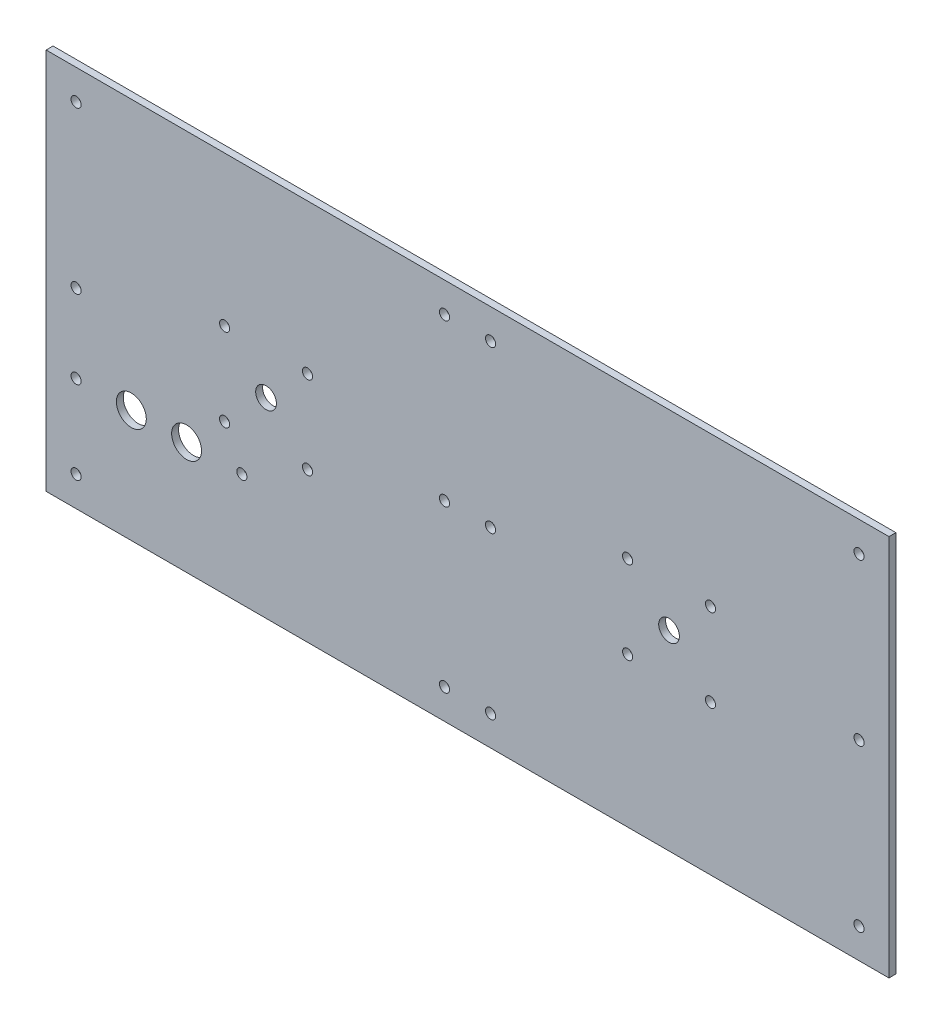
ISO-10303-21;
HEADER;
FILE_DESCRIPTION(('STEP AP214'),'2;1');
FILE_NAME('part.step','',(''),(''),'','','');
FILE_SCHEMA(('AUTOMOTIVE_DESIGN { 1 0 10303 214 1 1 1 1 }'));
ENDSEC;
DATA;
#1=APPLICATION_CONTEXT('core data for automotive mechanical design processes');
#2=APPLICATION_PROTOCOL_DEFINITION('international standard','automotive_design',2000,#1);
#3=PRODUCT_CONTEXT('',#1,'mechanical');
#4=PRODUCT('Part','Part','',(#3));
#5=PRODUCT_RELATED_PRODUCT_CATEGORY('part','',(#4));
#6=PRODUCT_DEFINITION_FORMATION('','',#4);
#7=PRODUCT_DEFINITION_CONTEXT('part definition',#1,'design');
#8=PRODUCT_DEFINITION('design','',#6,#7);
#9=PRODUCT_DEFINITION_SHAPE('','',#8);
#10=(LENGTH_UNIT() NAMED_UNIT(*) SI_UNIT(.MILLI.,.METRE.));
#11=(NAMED_UNIT(*) PLANE_ANGLE_UNIT() SI_UNIT($,.RADIAN.));
#12=(NAMED_UNIT(*) SI_UNIT($,.STERADIAN.) SOLID_ANGLE_UNIT());
#13=UNCERTAINTY_MEASURE_WITH_UNIT(LENGTH_MEASURE(1.E-05),#10,'distance_accuracy_value','');
#14=(GEOMETRIC_REPRESENTATION_CONTEXT(3) GLOBAL_UNCERTAINTY_ASSIGNED_CONTEXT((#13)) GLOBAL_UNIT_ASSIGNED_CONTEXT((#10,
#11,#12)) REPRESENTATION_CONTEXT('',''));
#15=CARTESIAN_POINT('',(0.,0.,0.));
#16=DIRECTION('',(0.,0.,1.));
#17=DIRECTION('',(1.,0.,0.));
#18=AXIS2_PLACEMENT_3D('',#15,#16,#17);
#19=CARTESIAN_POINT('',(0.,0.,3.));
#20=DIRECTION('',(0.,0.,-1.));
#21=DIRECTION('',(-1.,0.,0.));
#22=AXIS2_PLACEMENT_3D('',#19,#20,#21);
#23=PLANE('',#22);
#24=DIRECTION('',(0.,-1.,0.));
#25=VECTOR('',#24,1.);
#26=CARTESIAN_POINT('',(0.,0.,3.));
#27=LINE('',#26,#25);
#28=CARTESIAN_POINT('',(0.,166.,3.));
#29=VERTEX_POINT('',#28);
#30=CARTESIAN_POINT('',(0.,0.,3.));
#31=VERTEX_POINT('',#30);
#32=EDGE_CURVE('E93',#29,#31,#27,.T.);
#33=ORIENTED_EDGE('',*,*,#32,.T.);
#34=DIRECTION('',(1.,0.,0.));
#35=VECTOR('',#34,1.);
#36=CARTESIAN_POINT('',(0.,0.,3.));
#37=LINE('',#36,#35);
#38=CARTESIAN_POINT('',(366.,0.,3.));
#39=VERTEX_POINT('',#38);
#40=EDGE_CURVE('E88',#31,#39,#37,.T.);
#41=ORIENTED_EDGE('',*,*,#40,.T.);
#42=DIRECTION('',(0.,1.,0.));
#43=VECTOR('',#42,1.);
#44=CARTESIAN_POINT('',(366.,0.,3.));
#45=LINE('',#44,#43);
#46=CARTESIAN_POINT('',(366.,166.,3.));
#47=VERTEX_POINT('',#46);
#48=EDGE_CURVE('E91',#39,#47,#45,.T.);
#49=ORIENTED_EDGE('',*,*,#48,.T.);
#50=DIRECTION('',(-1.,0.,0.));
#51=VECTOR('',#50,1.);
#52=CARTESIAN_POINT('',(0.,166.,3.));
#53=LINE('',#52,#51);
#54=EDGE_CURVE('E58',#47,#29,#53,.T.);
#55=ORIENTED_EDGE('',*,*,#54,.T.);
#56=EDGE_LOOP('',(#33,#41,#49,#55));
#57=FACE_BOUND('',#56,.T.);
#58=CARTESIAN_POINT('',(13.,153.,3.));
#59=DIRECTION('',(0.,0.,1.));
#60=DIRECTION('',(1.,0.,0.));
#61=AXIS2_PLACEMENT_3D('',#58,#59,#60);
#62=CIRCLE('',#61,2.2);
#63=CARTESIAN_POINT('',(15.2,153.,3.));
#64=VERTEX_POINT('',#63);
#65=EDGE_CURVE('E121',#64,#64,#62,.T.);
#66=ORIENTED_EDGE('',*,*,#65,.F.);
#67=EDGE_LOOP('',(#66));
#68=FACE_BOUND('',#67,.T.);
#69=CARTESIAN_POINT('',(13.,13.,3.));
#70=DIRECTION('',(0.,0.,1.));
#71=DIRECTION('',(1.,0.,0.));
#72=AXIS2_PLACEMENT_3D('',#69,#70,#71);
#73=CIRCLE('',#72,2.2);
#74=CARTESIAN_POINT('',(15.2,13.,3.));
#75=VERTEX_POINT('',#74);
#76=EDGE_CURVE('E132',#75,#75,#73,.T.);
#77=ORIENTED_EDGE('',*,*,#76,.F.);
#78=EDGE_LOOP('',(#77));
#79=FACE_BOUND('',#78,.T.);
#80=CARTESIAN_POINT('',(13.,83.,3.));
#81=DIRECTION('',(0.,0.,1.));
#82=DIRECTION('',(1.,0.,0.));
#83=AXIS2_PLACEMENT_3D('',#80,#81,#82);
#84=CIRCLE('',#83,2.2);
#85=CARTESIAN_POINT('',(15.2,83.,3.));
#86=VERTEX_POINT('',#85);
#87=EDGE_CURVE('E158',#86,#86,#84,.T.);
#88=ORIENTED_EDGE('',*,*,#87,.F.);
#89=EDGE_LOOP('',(#88));
#90=FACE_BOUND('',#89,.T.);
#91=CARTESIAN_POINT('',(173.,153.,3.));
#92=DIRECTION('',(0.,0.,1.));
#93=DIRECTION('',(1.,0.,0.));
#94=AXIS2_PLACEMENT_3D('',#91,#92,#93);
#95=CIRCLE('',#94,2.20000000000001);
#96=CARTESIAN_POINT('',(175.2,153.,3.));
#97=VERTEX_POINT('',#96);
#98=EDGE_CURVE('E165',#97,#97,#95,.T.);
#99=ORIENTED_EDGE('',*,*,#98,.F.);
#100=EDGE_LOOP('',(#99));
#101=FACE_BOUND('',#100,.T.);
#102=CARTESIAN_POINT('',(193.,83.,3.));
#103=DIRECTION('',(0.,0.,1.));
#104=DIRECTION('',(1.,0.,0.));
#105=AXIS2_PLACEMENT_3D('',#102,#103,#104);
#106=CIRCLE('',#105,2.20000000000001);
#107=CARTESIAN_POINT('',(195.2,83.,3.));
#108=VERTEX_POINT('',#107);
#109=EDGE_CURVE('E173',#108,#108,#106,.T.);
#110=ORIENTED_EDGE('',*,*,#109,.F.);
#111=EDGE_LOOP('',(#110));
#112=FACE_BOUND('',#111,.T.);
#113=CARTESIAN_POINT('',(173.,83.,3.));
#114=DIRECTION('',(0.,0.,1.));
#115=DIRECTION('',(-1.,0.,0.));
#116=AXIS2_PLACEMENT_3D('',#113,#114,#115);
#117=CIRCLE('',#116,2.20000000000001);
#118=CARTESIAN_POINT('',(170.8,83.,3.));
#119=VERTEX_POINT('',#118);
#120=EDGE_CURVE('E181',#119,#119,#117,.T.);
#121=ORIENTED_EDGE('',*,*,#120,.F.);
#122=EDGE_LOOP('',(#121));
#123=FACE_BOUND('',#122,.T.);
#124=CARTESIAN_POINT('',(193.,153.,3.));
#125=DIRECTION('',(0.,0.,1.));
#126=DIRECTION('',(-1.,0.,0.));
#127=AXIS2_PLACEMENT_3D('',#124,#125,#126);
#128=CIRCLE('',#127,2.20000000000001);
#129=CARTESIAN_POINT('',(190.8,153.,3.));
#130=VERTEX_POINT('',#129);
#131=EDGE_CURVE('E189',#130,#130,#128,.T.);
#132=ORIENTED_EDGE('',*,*,#131,.F.);
#133=EDGE_LOOP('',(#132));
#134=FACE_BOUND('',#133,.T.);
#135=CARTESIAN_POINT('',(353.,83.,3.));
#136=DIRECTION('',(0.,0.,1.));
#137=DIRECTION('',(-1.,0.,0.));
#138=AXIS2_PLACEMENT_3D('',#135,#136,#137);
#139=CIRCLE('',#138,2.20000000000004);
#140=CARTESIAN_POINT('',(350.8,83.,3.));
#141=VERTEX_POINT('',#140);
#142=EDGE_CURVE('E197',#141,#141,#139,.T.);
#143=ORIENTED_EDGE('',*,*,#142,.F.);
#144=EDGE_LOOP('',(#143));
#145=FACE_BOUND('',#144,.T.);
#146=CARTESIAN_POINT('',(353.,13.,3.));
#147=DIRECTION('',(0.,0.,1.));
#148=DIRECTION('',(-1.,0.,0.));
#149=AXIS2_PLACEMENT_3D('',#146,#147,#148);
#150=CIRCLE('',#149,2.20000000000004);
#151=CARTESIAN_POINT('',(350.8,13.,3.));
#152=VERTEX_POINT('',#151);
#153=EDGE_CURVE('E205',#152,#152,#150,.T.);
#154=ORIENTED_EDGE('',*,*,#153,.F.);
#155=EDGE_LOOP('',(#154));
#156=FACE_BOUND('',#155,.T.);
#157=CARTESIAN_POINT('',(353.,153.,3.));
#158=DIRECTION('',(0.,0.,1.));
#159=DIRECTION('',(-1.,0.,0.));
#160=AXIS2_PLACEMENT_3D('',#157,#158,#159);
#161=CIRCLE('',#160,2.19999999999999);
#162=CARTESIAN_POINT('',(350.8,153.,3.));
#163=VERTEX_POINT('',#162);
#164=EDGE_CURVE('E213',#163,#163,#161,.T.);
#165=ORIENTED_EDGE('',*,*,#164,.F.);
#166=EDGE_LOOP('',(#165));
#167=FACE_BOUND('',#166,.T.);
#168=CARTESIAN_POINT('',(193.,13.,3.));
#169=DIRECTION('',(0.,0.,1.));
#170=DIRECTION('',(1.,0.,0.));
#171=AXIS2_PLACEMENT_3D('',#168,#169,#170);
#172=CIRCLE('',#171,2.20000000000001);
#173=CARTESIAN_POINT('',(195.2,13.,3.));
#174=VERTEX_POINT('',#173);
#175=EDGE_CURVE('E221',#174,#174,#172,.T.);
#176=ORIENTED_EDGE('',*,*,#175,.F.);
#177=EDGE_LOOP('',(#176));
#178=FACE_BOUND('',#177,.T.);
#179=CARTESIAN_POINT('',(173.,13.,3.));
#180=DIRECTION('',(0.,0.,1.));
#181=DIRECTION('',(-1.,0.,0.));
#182=AXIS2_PLACEMENT_3D('',#179,#180,#181);
#183=CIRCLE('',#182,2.20000000000001);
#184=CARTESIAN_POINT('',(170.8,13.,3.));
#185=VERTEX_POINT('',#184);
#186=EDGE_CURVE('E229',#185,#185,#183,.T.);
#187=ORIENTED_EDGE('',*,*,#186,.F.);
#188=EDGE_LOOP('',(#187));
#189=FACE_BOUND('',#188,.T.);
#190=CARTESIAN_POINT('',(270.5,83.,3.));
#191=DIRECTION('',(0.,0.,1.));
#192=DIRECTION('',(1.,0.,0.));
#193=AXIS2_PLACEMENT_3D('',#190,#191,#192);
#194=CIRCLE('',#193,4.50000000000002);
#195=CARTESIAN_POINT('',(275.,83.,3.));
#196=VERTEX_POINT('',#195);
#197=EDGE_CURVE('E237',#196,#196,#194,.T.);
#198=ORIENTED_EDGE('',*,*,#197,.F.);
#199=EDGE_LOOP('',(#198));
#200=FACE_BOUND('',#199,.T.);
#201=CARTESIAN_POINT('',(95.5,83.,3.));
#202=DIRECTION('',(0.,0.,1.));
#203=DIRECTION('',(-1.,0.,0.));
#204=AXIS2_PLACEMENT_3D('',#201,#202,#203);
#205=CIRCLE('',#204,4.49999999999999);
#206=CARTESIAN_POINT('',(91.,83.,3.));
#207=VERTEX_POINT('',#206);
#208=EDGE_CURVE('E245',#207,#207,#205,.T.);
#209=ORIENTED_EDGE('',*,*,#208,.F.);
#210=EDGE_LOOP('',(#209));
#211=FACE_BOUND('',#210,.T.);
#212=CARTESIAN_POINT('',(77.5,101.,3.));
#213=DIRECTION('',(0.,0.,1.));
#214=DIRECTION('',(1.,0.,0.));
#215=AXIS2_PLACEMENT_3D('',#212,#213,#214);
#216=CIRCLE('',#215,2.2);
#217=CARTESIAN_POINT('',(79.7,101.,3.));
#218=VERTEX_POINT('',#217);
#219=EDGE_CURVE('E253',#218,#218,#216,.T.);
#220=ORIENTED_EDGE('',*,*,#219,.F.);
#221=EDGE_LOOP('',(#220));
#222=FACE_BOUND('',#221,.T.);
#223=CARTESIAN_POINT('',(113.5,101.,3.));
#224=DIRECTION('',(0.,0.,1.));
#225=DIRECTION('',(1.,0.,0.));
#226=AXIS2_PLACEMENT_3D('',#223,#224,#225);
#227=CIRCLE('',#226,2.2);
#228=CARTESIAN_POINT('',(115.7,101.,3.));
#229=VERTEX_POINT('',#228);
#230=EDGE_CURVE('E261',#229,#229,#227,.T.);
#231=ORIENTED_EDGE('',*,*,#230,.F.);
#232=EDGE_LOOP('',(#231));
#233=FACE_BOUND('',#232,.T.);
#234=CARTESIAN_POINT('',(77.5,65.,3.));
#235=DIRECTION('',(0.,0.,1.));
#236=DIRECTION('',(1.,0.,0.));
#237=AXIS2_PLACEMENT_3D('',#234,#235,#236);
#238=CIRCLE('',#237,2.2);
#239=CARTESIAN_POINT('',(79.7,65.,3.));
#240=VERTEX_POINT('',#239);
#241=EDGE_CURVE('E269',#240,#240,#238,.T.);
#242=ORIENTED_EDGE('',*,*,#241,.F.);
#243=EDGE_LOOP('',(#242));
#244=FACE_BOUND('',#243,.T.);
#245=CARTESIAN_POINT('',(113.5,65.,3.));
#246=DIRECTION('',(0.,0.,1.));
#247=DIRECTION('',(1.,0.,0.));
#248=AXIS2_PLACEMENT_3D('',#245,#246,#247);
#249=CIRCLE('',#248,2.2);
#250=CARTESIAN_POINT('',(115.7,65.,3.));
#251=VERTEX_POINT('',#250);
#252=EDGE_CURVE('E277',#251,#251,#249,.T.);
#253=ORIENTED_EDGE('',*,*,#252,.F.);
#254=EDGE_LOOP('',(#253));
#255=FACE_BOUND('',#254,.T.);
#256=CARTESIAN_POINT('',(288.5,65.,3.));
#257=DIRECTION('',(0.,0.,1.));
#258=DIRECTION('',(-1.,0.,0.));
#259=AXIS2_PLACEMENT_3D('',#256,#257,#258);
#260=CIRCLE('',#259,2.20000000000004);
#261=CARTESIAN_POINT('',(286.3,65.,3.));
#262=VERTEX_POINT('',#261);
#263=EDGE_CURVE('E285',#262,#262,#260,.T.);
#264=ORIENTED_EDGE('',*,*,#263,.F.);
#265=EDGE_LOOP('',(#264));
#266=FACE_BOUND('',#265,.T.);
#267=CARTESIAN_POINT('',(252.5,65.,3.));
#268=DIRECTION('',(0.,0.,1.));
#269=DIRECTION('',(-1.,0.,0.));
#270=AXIS2_PLACEMENT_3D('',#267,#268,#269);
#271=CIRCLE('',#270,2.19999999999998);
#272=CARTESIAN_POINT('',(250.3,65.,3.));
#273=VERTEX_POINT('',#272);
#274=EDGE_CURVE('E293',#273,#273,#271,.T.);
#275=ORIENTED_EDGE('',*,*,#274,.F.);
#276=EDGE_LOOP('',(#275));
#277=FACE_BOUND('',#276,.T.);
#278=CARTESIAN_POINT('',(252.5,101.,3.));
#279=DIRECTION('',(0.,0.,1.));
#280=DIRECTION('',(-1.,0.,0.));
#281=AXIS2_PLACEMENT_3D('',#278,#279,#280);
#282=CIRCLE('',#281,2.19999999999998);
#283=CARTESIAN_POINT('',(250.3,101.,3.));
#284=VERTEX_POINT('',#283);
#285=EDGE_CURVE('E301',#284,#284,#282,.T.);
#286=ORIENTED_EDGE('',*,*,#285,.F.);
#287=EDGE_LOOP('',(#286));
#288=FACE_BOUND('',#287,.T.);
#289=CARTESIAN_POINT('',(288.5,101.,3.));
#290=DIRECTION('',(0.,0.,1.));
#291=DIRECTION('',(-1.,0.,0.));
#292=AXIS2_PLACEMENT_3D('',#289,#290,#291);
#293=CIRCLE('',#292,2.20000000000004);
#294=CARTESIAN_POINT('',(286.3,101.,3.));
#295=VERTEX_POINT('',#294);
#296=EDGE_CURVE('E309',#295,#295,#293,.T.);
#297=ORIENTED_EDGE('',*,*,#296,.F.);
#298=EDGE_LOOP('',(#297));
#299=FACE_BOUND('',#298,.T.);
#300=CARTESIAN_POINT('',(37.,49.,3.));
#301=DIRECTION('',(0.,0.,1.));
#302=DIRECTION('',(1.,0.,0.));
#303=AXIS2_PLACEMENT_3D('',#300,#301,#302);
#304=CIRCLE('',#303,6.5);
#305=CARTESIAN_POINT('',(43.5,49.,3.));
#306=VERTEX_POINT('',#305);
#307=EDGE_CURVE('E317',#306,#306,#304,.T.);
#308=ORIENTED_EDGE('',*,*,#307,.F.);
#309=EDGE_LOOP('',(#308));
#310=FACE_BOUND('',#309,.T.);
#311=CARTESIAN_POINT('',(61.,49.,3.));
#312=DIRECTION('',(0.,0.,1.));
#313=DIRECTION('',(1.,0.,0.));
#314=AXIS2_PLACEMENT_3D('',#311,#312,#313);
#315=CIRCLE('',#314,6.5);
#316=CARTESIAN_POINT('',(67.5,49.,3.));
#317=VERTEX_POINT('',#316);
#318=EDGE_CURVE('E325',#317,#317,#315,.T.);
#319=ORIENTED_EDGE('',*,*,#318,.F.);
#320=EDGE_LOOP('',(#319));
#321=FACE_BOUND('',#320,.T.);
#322=CARTESIAN_POINT('',(85.,49.,3.));
#323=DIRECTION('',(0.,0.,1.));
#324=DIRECTION('',(1.,0.,0.));
#325=AXIS2_PLACEMENT_3D('',#322,#323,#324);
#326=CIRCLE('',#325,2.2);
#327=CARTESIAN_POINT('',(87.2,49.,3.));
#328=VERTEX_POINT('',#327);
#329=EDGE_CURVE('E333',#328,#328,#326,.T.);
#330=ORIENTED_EDGE('',*,*,#329,.F.);
#331=EDGE_LOOP('',(#330));
#332=FACE_BOUND('',#331,.T.);
#333=CARTESIAN_POINT('',(13.,49.,3.));
#334=DIRECTION('',(0.,0.,1.));
#335=DIRECTION('',(1.,0.,0.));
#336=AXIS2_PLACEMENT_3D('',#333,#334,#335);
#337=CIRCLE('',#336,2.2);
#338=CARTESIAN_POINT('',(15.2,49.,3.));
#339=VERTEX_POINT('',#338);
#340=EDGE_CURVE('E341',#339,#339,#337,.T.);
#341=ORIENTED_EDGE('',*,*,#340,.F.);
#342=EDGE_LOOP('',(#341));
#343=FACE_BOUND('',#342,.T.);
#344=ADVANCED_FACE('F40',(#57,#68,#79,#90,#101,#112,#123,#134,#145,#156,#167,#178,#189,#200,
#211,#222,#233,#244,#255,#266,#277,#288,#299,#310,#321,#332,#343),#23,.F.);
#345=CARTESIAN_POINT('',(0.,0.,0.));
#346=DIRECTION('',(0.,0.,-1.));
#347=DIRECTION('',(-1.,0.,0.));
#348=AXIS2_PLACEMENT_3D('',#345,#346,#347);
#349=PLANE('',#348);
#350=CARTESIAN_POINT('',(85.,49.,0.));
#351=DIRECTION('',(0.,0.,1.));
#352=DIRECTION('',(1.,0.,0.));
#353=AXIS2_PLACEMENT_3D('',#350,#351,#352);
#354=CIRCLE('',#353,2.2);
#355=CARTESIAN_POINT('',(87.2,49.,0.));
#356=VERTEX_POINT('',#355);
#357=EDGE_CURVE('E337',#356,#356,#354,.T.);
#358=ORIENTED_EDGE('',*,*,#357,.T.);
#359=EDGE_LOOP('',(#358));
#360=FACE_BOUND('',#359,.T.);
#361=CARTESIAN_POINT('',(37.,49.,0.));
#362=DIRECTION('',(0.,0.,1.));
#363=DIRECTION('',(1.,0.,0.));
#364=AXIS2_PLACEMENT_3D('',#361,#362,#363);
#365=CIRCLE('',#364,6.5);
#366=CARTESIAN_POINT('',(43.5,49.,0.));
#367=VERTEX_POINT('',#366);
#368=EDGE_CURVE('E321',#367,#367,#365,.T.);
#369=ORIENTED_EDGE('',*,*,#368,.T.);
#370=EDGE_LOOP('',(#369));
#371=FACE_BOUND('',#370,.T.);
#372=CARTESIAN_POINT('',(252.5,101.,0.));
#373=DIRECTION('',(0.,0.,1.));
#374=DIRECTION('',(-1.,0.,0.));
#375=AXIS2_PLACEMENT_3D('',#372,#373,#374);
#376=CIRCLE('',#375,2.19999999999998);
#377=CARTESIAN_POINT('',(250.3,101.,0.));
#378=VERTEX_POINT('',#377);
#379=EDGE_CURVE('E305',#378,#378,#376,.T.);
#380=ORIENTED_EDGE('',*,*,#379,.T.);
#381=EDGE_LOOP('',(#380));
#382=FACE_BOUND('',#381,.T.);
#383=CARTESIAN_POINT('',(288.5,65.,0.));
#384=DIRECTION('',(0.,0.,1.));
#385=DIRECTION('',(-1.,0.,0.));
#386=AXIS2_PLACEMENT_3D('',#383,#384,#385);
#387=CIRCLE('',#386,2.20000000000004);
#388=CARTESIAN_POINT('',(286.3,65.,0.));
#389=VERTEX_POINT('',#388);
#390=EDGE_CURVE('E289',#389,#389,#387,.T.);
#391=ORIENTED_EDGE('',*,*,#390,.T.);
#392=EDGE_LOOP('',(#391));
#393=FACE_BOUND('',#392,.T.);
#394=CARTESIAN_POINT('',(77.5,65.,0.));
#395=DIRECTION('',(0.,0.,1.));
#396=DIRECTION('',(1.,0.,0.));
#397=AXIS2_PLACEMENT_3D('',#394,#395,#396);
#398=CIRCLE('',#397,2.2);
#399=CARTESIAN_POINT('',(79.7,65.,0.));
#400=VERTEX_POINT('',#399);
#401=EDGE_CURVE('E273',#400,#400,#398,.T.);
#402=ORIENTED_EDGE('',*,*,#401,.T.);
#403=EDGE_LOOP('',(#402));
#404=FACE_BOUND('',#403,.T.);
#405=CARTESIAN_POINT('',(77.5,101.,0.));
#406=DIRECTION('',(0.,0.,1.));
#407=DIRECTION('',(1.,0.,0.));
#408=AXIS2_PLACEMENT_3D('',#405,#406,#407);
#409=CIRCLE('',#408,2.2);
#410=CARTESIAN_POINT('',(79.7,101.,0.));
#411=VERTEX_POINT('',#410);
#412=EDGE_CURVE('E257',#411,#411,#409,.T.);
#413=ORIENTED_EDGE('',*,*,#412,.T.);
#414=EDGE_LOOP('',(#413));
#415=FACE_BOUND('',#414,.T.);
#416=CARTESIAN_POINT('',(270.5,83.,0.));
#417=DIRECTION('',(0.,0.,1.));
#418=DIRECTION('',(1.,0.,0.));
#419=AXIS2_PLACEMENT_3D('',#416,#417,#418);
#420=CIRCLE('',#419,4.50000000000002);
#421=CARTESIAN_POINT('',(275.,83.,0.));
#422=VERTEX_POINT('',#421);
#423=EDGE_CURVE('E241',#422,#422,#420,.T.);
#424=ORIENTED_EDGE('',*,*,#423,.T.);
#425=EDGE_LOOP('',(#424));
#426=FACE_BOUND('',#425,.T.);
#427=CARTESIAN_POINT('',(193.,13.,0.));
#428=DIRECTION('',(0.,0.,1.));
#429=DIRECTION('',(1.,0.,0.));
#430=AXIS2_PLACEMENT_3D('',#427,#428,#429);
#431=CIRCLE('',#430,2.20000000000001);
#432=CARTESIAN_POINT('',(195.2,13.,0.));
#433=VERTEX_POINT('',#432);
#434=EDGE_CURVE('E225',#433,#433,#431,.T.);
#435=ORIENTED_EDGE('',*,*,#434,.T.);
#436=EDGE_LOOP('',(#435));
#437=FACE_BOUND('',#436,.T.);
#438=CARTESIAN_POINT('',(353.,13.,0.));
#439=DIRECTION('',(0.,0.,1.));
#440=DIRECTION('',(-1.,0.,0.));
#441=AXIS2_PLACEMENT_3D('',#438,#439,#440);
#442=CIRCLE('',#441,2.20000000000004);
#443=CARTESIAN_POINT('',(350.8,13.,0.));
#444=VERTEX_POINT('',#443);
#445=EDGE_CURVE('E209',#444,#444,#442,.T.);
#446=ORIENTED_EDGE('',*,*,#445,.T.);
#447=EDGE_LOOP('',(#446));
#448=FACE_BOUND('',#447,.T.);
#449=CARTESIAN_POINT('',(193.,153.,0.));
#450=DIRECTION('',(0.,0.,1.));
#451=DIRECTION('',(-1.,0.,0.));
#452=AXIS2_PLACEMENT_3D('',#449,#450,#451);
#453=CIRCLE('',#452,2.20000000000001);
#454=CARTESIAN_POINT('',(190.8,153.,0.));
#455=VERTEX_POINT('',#454);
#456=EDGE_CURVE('E193',#455,#455,#453,.T.);
#457=ORIENTED_EDGE('',*,*,#456,.T.);
#458=EDGE_LOOP('',(#457));
#459=FACE_BOUND('',#458,.T.);
#460=CARTESIAN_POINT('',(193.,83.,0.));
#461=DIRECTION('',(0.,0.,1.));
#462=DIRECTION('',(1.,0.,0.));
#463=AXIS2_PLACEMENT_3D('',#460,#461,#462);
#464=CIRCLE('',#463,2.20000000000001);
#465=CARTESIAN_POINT('',(195.2,83.,0.));
#466=VERTEX_POINT('',#465);
#467=EDGE_CURVE('E177',#466,#466,#464,.T.);
#468=ORIENTED_EDGE('',*,*,#467,.T.);
#469=EDGE_LOOP('',(#468));
#470=FACE_BOUND('',#469,.T.);
#471=CARTESIAN_POINT('',(13.,83.,0.));
#472=DIRECTION('',(0.,0.,1.));
#473=DIRECTION('',(1.,0.,0.));
#474=AXIS2_PLACEMENT_3D('',#471,#472,#473);
#475=CIRCLE('',#474,2.2);
#476=CARTESIAN_POINT('',(15.2,83.,0.));
#477=VERTEX_POINT('',#476);
#478=EDGE_CURVE('E161',#477,#477,#475,.T.);
#479=ORIENTED_EDGE('',*,*,#478,.T.);
#480=EDGE_LOOP('',(#479));
#481=FACE_BOUND('',#480,.T.);
#482=CARTESIAN_POINT('',(13.,153.,0.));
#483=DIRECTION('',(0.,0.,1.));
#484=DIRECTION('',(1.,0.,0.));
#485=AXIS2_PLACEMENT_3D('',#482,#483,#484);
#486=CIRCLE('',#485,2.2);
#487=CARTESIAN_POINT('',(15.2,153.,0.));
#488=VERTEX_POINT('',#487);
#489=EDGE_CURVE('E128',#488,#488,#486,.T.);
#490=ORIENTED_EDGE('',*,*,#489,.T.);
#491=EDGE_LOOP('',(#490));
#492=FACE_BOUND('',#491,.T.);
#493=DIRECTION('',(0.,-1.,0.));
#494=VECTOR('',#493,1.);
#495=CARTESIAN_POINT('',(0.,0.,0.));
#496=LINE('',#495,#494);
#497=CARTESIAN_POINT('',(0.,166.,0.));
#498=VERTEX_POINT('',#497);
#499=CARTESIAN_POINT('',(0.,0.,0.));
#500=VERTEX_POINT('',#499);
#501=EDGE_CURVE('E127',#498,#500,#496,.T.);
#502=ORIENTED_EDGE('',*,*,#501,.F.);
#503=DIRECTION('',(-1.,0.,0.));
#504=VECTOR('',#503,1.);
#505=CARTESIAN_POINT('',(0.,166.,0.));
#506=LINE('',#505,#504);
#507=CARTESIAN_POINT('',(366.,166.,0.));
#508=VERTEX_POINT('',#507);
#509=EDGE_CURVE('E81',#508,#498,#506,.T.);
#510=ORIENTED_EDGE('',*,*,#509,.F.);
#511=DIRECTION('',(0.,1.,0.));
#512=VECTOR('',#511,1.);
#513=CARTESIAN_POINT('',(366.,0.,0.));
#514=LINE('',#513,#512);
#515=CARTESIAN_POINT('',(366.,0.,0.));
#516=VERTEX_POINT('',#515);
#517=EDGE_CURVE('E75',#516,#508,#514,.T.);
#518=ORIENTED_EDGE('',*,*,#517,.F.);
#519=DIRECTION('',(1.,0.,0.));
#520=VECTOR('',#519,1.);
#521=CARTESIAN_POINT('',(0.,0.,0.));
#522=LINE('',#521,#520);
#523=EDGE_CURVE('E98',#500,#516,#522,.T.);
#524=ORIENTED_EDGE('',*,*,#523,.F.);
#525=EDGE_LOOP('',(#502,#510,#518,#524));
#526=FACE_BOUND('',#525,.T.);
#527=CARTESIAN_POINT('',(13.,13.,0.));
#528=DIRECTION('',(0.,0.,1.));
#529=DIRECTION('',(1.,0.,0.));
#530=AXIS2_PLACEMENT_3D('',#527,#528,#529);
#531=CIRCLE('',#530,2.2);
#532=CARTESIAN_POINT('',(15.2,13.,0.));
#533=VERTEX_POINT('',#532);
#534=EDGE_CURVE('E129',#533,#533,#531,.T.);
#535=ORIENTED_EDGE('',*,*,#534,.T.);
#536=EDGE_LOOP('',(#535));
#537=FACE_BOUND('',#536,.T.);
#538=CARTESIAN_POINT('',(173.,153.,0.));
#539=DIRECTION('',(0.,0.,1.));
#540=DIRECTION('',(1.,0.,0.));
#541=AXIS2_PLACEMENT_3D('',#538,#539,#540);
#542=CIRCLE('',#541,2.20000000000001);
#543=CARTESIAN_POINT('',(175.2,153.,0.));
#544=VERTEX_POINT('',#543);
#545=EDGE_CURVE('E169',#544,#544,#542,.T.);
#546=ORIENTED_EDGE('',*,*,#545,.T.);
#547=EDGE_LOOP('',(#546));
#548=FACE_BOUND('',#547,.T.);
#549=CARTESIAN_POINT('',(173.,83.,0.));
#550=DIRECTION('',(0.,0.,1.));
#551=DIRECTION('',(-1.,0.,0.));
#552=AXIS2_PLACEMENT_3D('',#549,#550,#551);
#553=CIRCLE('',#552,2.20000000000001);
#554=CARTESIAN_POINT('',(170.8,83.,0.));
#555=VERTEX_POINT('',#554);
#556=EDGE_CURVE('E185',#555,#555,#553,.T.);
#557=ORIENTED_EDGE('',*,*,#556,.T.);
#558=EDGE_LOOP('',(#557));
#559=FACE_BOUND('',#558,.T.);
#560=CARTESIAN_POINT('',(353.,83.,0.));
#561=DIRECTION('',(0.,0.,1.));
#562=DIRECTION('',(-1.,0.,0.));
#563=AXIS2_PLACEMENT_3D('',#560,#561,#562);
#564=CIRCLE('',#563,2.20000000000004);
#565=CARTESIAN_POINT('',(350.8,83.,0.));
#566=VERTEX_POINT('',#565);
#567=EDGE_CURVE('E201',#566,#566,#564,.T.);
#568=ORIENTED_EDGE('',*,*,#567,.T.);
#569=EDGE_LOOP('',(#568));
#570=FACE_BOUND('',#569,.T.);
#571=CARTESIAN_POINT('',(353.,153.,0.));
#572=DIRECTION('',(0.,0.,1.));
#573=DIRECTION('',(-1.,0.,0.));
#574=AXIS2_PLACEMENT_3D('',#571,#572,#573);
#575=CIRCLE('',#574,2.19999999999999);
#576=CARTESIAN_POINT('',(350.8,153.,0.));
#577=VERTEX_POINT('',#576);
#578=EDGE_CURVE('E217',#577,#577,#575,.T.);
#579=ORIENTED_EDGE('',*,*,#578,.T.);
#580=EDGE_LOOP('',(#579));
#581=FACE_BOUND('',#580,.T.);
#582=CARTESIAN_POINT('',(173.,13.,0.));
#583=DIRECTION('',(0.,0.,1.));
#584=DIRECTION('',(-1.,0.,0.));
#585=AXIS2_PLACEMENT_3D('',#582,#583,#584);
#586=CIRCLE('',#585,2.20000000000001);
#587=CARTESIAN_POINT('',(170.8,13.,0.));
#588=VERTEX_POINT('',#587);
#589=EDGE_CURVE('E233',#588,#588,#586,.T.);
#590=ORIENTED_EDGE('',*,*,#589,.T.);
#591=EDGE_LOOP('',(#590));
#592=FACE_BOUND('',#591,.T.);
#593=CARTESIAN_POINT('',(95.5,83.,0.));
#594=DIRECTION('',(0.,0.,1.));
#595=DIRECTION('',(-1.,0.,0.));
#596=AXIS2_PLACEMENT_3D('',#593,#594,#595);
#597=CIRCLE('',#596,4.49999999999999);
#598=CARTESIAN_POINT('',(91.,83.,0.));
#599=VERTEX_POINT('',#598);
#600=EDGE_CURVE('E249',#599,#599,#597,.T.);
#601=ORIENTED_EDGE('',*,*,#600,.T.);
#602=EDGE_LOOP('',(#601));
#603=FACE_BOUND('',#602,.T.);
#604=CARTESIAN_POINT('',(113.5,101.,0.));
#605=DIRECTION('',(0.,0.,1.));
#606=DIRECTION('',(1.,0.,0.));
#607=AXIS2_PLACEMENT_3D('',#604,#605,#606);
#608=CIRCLE('',#607,2.2);
#609=CARTESIAN_POINT('',(115.7,101.,0.));
#610=VERTEX_POINT('',#609);
#611=EDGE_CURVE('E265',#610,#610,#608,.T.);
#612=ORIENTED_EDGE('',*,*,#611,.T.);
#613=EDGE_LOOP('',(#612));
#614=FACE_BOUND('',#613,.T.);
#615=CARTESIAN_POINT('',(113.5,65.,0.));
#616=DIRECTION('',(0.,0.,1.));
#617=DIRECTION('',(1.,0.,0.));
#618=AXIS2_PLACEMENT_3D('',#615,#616,#617);
#619=CIRCLE('',#618,2.2);
#620=CARTESIAN_POINT('',(115.7,65.,0.));
#621=VERTEX_POINT('',#620);
#622=EDGE_CURVE('E281',#621,#621,#619,.T.);
#623=ORIENTED_EDGE('',*,*,#622,.T.);
#624=EDGE_LOOP('',(#623));
#625=FACE_BOUND('',#624,.T.);
#626=CARTESIAN_POINT('',(252.5,65.,0.));
#627=DIRECTION('',(0.,0.,1.));
#628=DIRECTION('',(-1.,0.,0.));
#629=AXIS2_PLACEMENT_3D('',#626,#627,#628);
#630=CIRCLE('',#629,2.19999999999998);
#631=CARTESIAN_POINT('',(250.3,65.,0.));
#632=VERTEX_POINT('',#631);
#633=EDGE_CURVE('E297',#632,#632,#630,.T.);
#634=ORIENTED_EDGE('',*,*,#633,.T.);
#635=EDGE_LOOP('',(#634));
#636=FACE_BOUND('',#635,.T.);
#637=CARTESIAN_POINT('',(288.5,101.,0.));
#638=DIRECTION('',(0.,0.,1.));
#639=DIRECTION('',(-1.,0.,0.));
#640=AXIS2_PLACEMENT_3D('',#637,#638,#639);
#641=CIRCLE('',#640,2.20000000000004);
#642=CARTESIAN_POINT('',(286.3,101.,0.));
#643=VERTEX_POINT('',#642);
#644=EDGE_CURVE('E313',#643,#643,#641,.T.);
#645=ORIENTED_EDGE('',*,*,#644,.T.);
#646=EDGE_LOOP('',(#645));
#647=FACE_BOUND('',#646,.T.);
#648=CARTESIAN_POINT('',(61.,49.,0.));
#649=DIRECTION('',(0.,0.,1.));
#650=DIRECTION('',(1.,0.,0.));
#651=AXIS2_PLACEMENT_3D('',#648,#649,#650);
#652=CIRCLE('',#651,6.5);
#653=CARTESIAN_POINT('',(67.5,49.,0.));
#654=VERTEX_POINT('',#653);
#655=EDGE_CURVE('E329',#654,#654,#652,.T.);
#656=ORIENTED_EDGE('',*,*,#655,.T.);
#657=EDGE_LOOP('',(#656));
#658=FACE_BOUND('',#657,.T.);
#659=CARTESIAN_POINT('',(13.,49.,0.));
#660=DIRECTION('',(0.,0.,1.));
#661=DIRECTION('',(1.,0.,0.));
#662=AXIS2_PLACEMENT_3D('',#659,#660,#661);
#663=CIRCLE('',#662,2.2);
#664=CARTESIAN_POINT('',(15.2,49.,0.));
#665=VERTEX_POINT('',#664);
#666=EDGE_CURVE('E345',#665,#665,#663,.T.);
#667=ORIENTED_EDGE('',*,*,#666,.T.);
#668=EDGE_LOOP('',(#667));
#669=FACE_BOUND('',#668,.T.);
#670=ADVANCED_FACE('F147',(#360,#371,#382,#393,#404,#415,#426,#437,#448,#459,#470,#481,#492,
#526,#537,#548,#559,#570,#581,#592,#603,#614,#625,#636,#647,#658,#669),#349,.T.);
#671=CARTESIAN_POINT('',(0.,0.,3.));
#672=DIRECTION('',(1.,0.,0.));
#673=DIRECTION('',(0.,0.,-1.));
#674=AXIS2_PLACEMENT_3D('',#671,#672,#673);
#675=PLANE('',#674);
#676=ORIENTED_EDGE('',*,*,#501,.T.);
#677=DIRECTION('',(0.,0.,-1.));
#678=VECTOR('',#677,1.);
#679=CARTESIAN_POINT('',(0.,0.,3.));
#680=LINE('',#679,#678);
#681=EDGE_CURVE('E12',#31,#500,#680,.T.);
#682=ORIENTED_EDGE('',*,*,#681,.F.);
#683=ORIENTED_EDGE('',*,*,#32,.F.);
#684=DIRECTION('',(0.,0.,-1.));
#685=VECTOR('',#684,1.);
#686=CARTESIAN_POINT('',(0.,166.,3.));
#687=LINE('',#686,#685);
#688=EDGE_CURVE('E105',#29,#498,#687,.T.);
#689=ORIENTED_EDGE('',*,*,#688,.T.);
#690=EDGE_LOOP('',(#676,#682,#683,#689));
#691=FACE_BOUND('',#690,.T.);
#692=ADVANCED_FACE('F42',(#691),#675,.F.);
#693=CARTESIAN_POINT('',(0.,0.,3.));
#694=DIRECTION('',(0.,1.,0.));
#695=DIRECTION('',(0.,0.,1.));
#696=AXIS2_PLACEMENT_3D('',#693,#694,#695);
#697=PLANE('',#696);
#698=ORIENTED_EDGE('',*,*,#523,.T.);
#699=DIRECTION('',(0.,0.,-1.));
#700=VECTOR('',#699,1.);
#701=CARTESIAN_POINT('',(366.,0.,3.));
#702=LINE('',#701,#700);
#703=EDGE_CURVE('E50',#39,#516,#702,.T.);
#704=ORIENTED_EDGE('',*,*,#703,.F.);
#705=ORIENTED_EDGE('',*,*,#40,.F.);
#706=ORIENTED_EDGE('',*,*,#681,.T.);
#707=EDGE_LOOP('',(#698,#704,#705,#706));
#708=FACE_BOUND('',#707,.T.);
#709=ADVANCED_FACE('F97',(#708),#697,.F.);
#710=CARTESIAN_POINT('',(366.,0.,3.));
#711=DIRECTION('',(-1.,0.,0.));
#712=DIRECTION('',(0.,0.,1.));
#713=AXIS2_PLACEMENT_3D('',#710,#711,#712);
#714=PLANE('',#713);
#715=ORIENTED_EDGE('',*,*,#517,.T.);
#716=DIRECTION('',(0.,0.,-1.));
#717=VECTOR('',#716,1.);
#718=CARTESIAN_POINT('',(366.,166.,3.));
#719=LINE('',#718,#717);
#720=EDGE_CURVE('E100',#47,#508,#719,.T.);
#721=ORIENTED_EDGE('',*,*,#720,.F.);
#722=ORIENTED_EDGE('',*,*,#48,.F.);
#723=ORIENTED_EDGE('',*,*,#703,.T.);
#724=EDGE_LOOP('',(#715,#721,#722,#723));
#725=FACE_BOUND('',#724,.T.);
#726=ADVANCED_FACE('F101',(#725),#714,.F.);
#727=CARTESIAN_POINT('',(0.,166.,3.));
#728=DIRECTION('',(0.,-1.,0.));
#729=DIRECTION('',(0.,0.,-1.));
#730=AXIS2_PLACEMENT_3D('',#727,#728,#729);
#731=PLANE('',#730);
#732=ORIENTED_EDGE('',*,*,#509,.T.);
#733=ORIENTED_EDGE('',*,*,#688,.F.);
#734=ORIENTED_EDGE('',*,*,#54,.F.);
#735=ORIENTED_EDGE('',*,*,#720,.T.);
#736=EDGE_LOOP('',(#732,#733,#734,#735));
#737=FACE_BOUND('',#736,.T.);
#738=ADVANCED_FACE('F144',(#737),#731,.F.);
#739=CARTESIAN_POINT('',(13.,153.,3.));
#740=DIRECTION('',(0.,0.,-1.));
#741=DIRECTION('',(-1.,0.,0.));
#742=AXIS2_PLACEMENT_3D('',#739,#740,#741);
#743=CYLINDRICAL_SURFACE('',#742,2.2);
#744=ORIENTED_EDGE('',*,*,#65,.T.);
#745=EDGE_LOOP('',(#744));
#746=FACE_BOUND('',#745,.T.);
#747=ORIENTED_EDGE('',*,*,#489,.F.);
#748=EDGE_LOOP('',(#747));
#749=FACE_BOUND('',#748,.T.);
#750=ADVANCED_FACE('F416',(#746,#749),#743,.F.);
#751=CARTESIAN_POINT('',(13.,13.,3.));
#752=DIRECTION('',(0.,0.,-1.));
#753=DIRECTION('',(-1.,0.,0.));
#754=AXIS2_PLACEMENT_3D('',#751,#752,#753);
#755=CYLINDRICAL_SURFACE('',#754,2.2);
#756=ORIENTED_EDGE('',*,*,#76,.T.);
#757=EDGE_LOOP('',(#756));
#758=FACE_BOUND('',#757,.T.);
#759=ORIENTED_EDGE('',*,*,#534,.F.);
#760=EDGE_LOOP('',(#759));
#761=FACE_BOUND('',#760,.T.);
#762=ADVANCED_FACE('F462',(#758,#761),#755,.F.);
#763=CARTESIAN_POINT('',(13.,83.,3.));
#764=DIRECTION('',(0.,0.,-1.));
#765=DIRECTION('',(-1.,0.,0.));
#766=AXIS2_PLACEMENT_3D('',#763,#764,#765);
#767=CYLINDRICAL_SURFACE('',#766,2.2);
#768=ORIENTED_EDGE('',*,*,#87,.T.);
#769=EDGE_LOOP('',(#768));
#770=FACE_BOUND('',#769,.T.);
#771=ORIENTED_EDGE('',*,*,#478,.F.);
#772=EDGE_LOOP('',(#771));
#773=FACE_BOUND('',#772,.T.);
#774=ADVANCED_FACE('F470',(#770,#773),#767,.F.);
#775=CARTESIAN_POINT('',(173.,153.,3.));
#776=DIRECTION('',(0.,0.,-1.));
#777=DIRECTION('',(-1.,0.,0.));
#778=AXIS2_PLACEMENT_3D('',#775,#776,#777);
#779=CYLINDRICAL_SURFACE('',#778,2.20000000000001);
#780=ORIENTED_EDGE('',*,*,#98,.T.);
#781=EDGE_LOOP('',(#780));
#782=FACE_BOUND('',#781,.T.);
#783=ORIENTED_EDGE('',*,*,#545,.F.);
#784=EDGE_LOOP('',(#783));
#785=FACE_BOUND('',#784,.T.);
#786=ADVANCED_FACE('F478',(#782,#785),#779,.F.);
#787=CARTESIAN_POINT('',(193.,83.,3.));
#788=DIRECTION('',(0.,0.,-1.));
#789=DIRECTION('',(-1.,0.,0.));
#790=AXIS2_PLACEMENT_3D('',#787,#788,#789);
#791=CYLINDRICAL_SURFACE('',#790,2.20000000000001);
#792=ORIENTED_EDGE('',*,*,#109,.T.);
#793=EDGE_LOOP('',(#792));
#794=FACE_BOUND('',#793,.T.);
#795=ORIENTED_EDGE('',*,*,#467,.F.);
#796=EDGE_LOOP('',(#795));
#797=FACE_BOUND('',#796,.T.);
#798=ADVANCED_FACE('F487',(#794,#797),#791,.F.);
#799=CARTESIAN_POINT('',(173.,83.,3.));
#800=DIRECTION('',(0.,0.,-1.));
#801=DIRECTION('',(-1.,0.,0.));
#802=AXIS2_PLACEMENT_3D('',#799,#800,#801);
#803=CYLINDRICAL_SURFACE('',#802,2.20000000000001);
#804=ORIENTED_EDGE('',*,*,#120,.T.);
#805=EDGE_LOOP('',(#804));
#806=FACE_BOUND('',#805,.T.);
#807=ORIENTED_EDGE('',*,*,#556,.F.);
#808=EDGE_LOOP('',(#807));
#809=FACE_BOUND('',#808,.T.);
#810=ADVANCED_FACE('F496',(#806,#809),#803,.F.);
#811=CARTESIAN_POINT('',(193.,153.,3.));
#812=DIRECTION('',(0.,0.,-1.));
#813=DIRECTION('',(-1.,0.,0.));
#814=AXIS2_PLACEMENT_3D('',#811,#812,#813);
#815=CYLINDRICAL_SURFACE('',#814,2.20000000000001);
#816=ORIENTED_EDGE('',*,*,#131,.T.);
#817=EDGE_LOOP('',(#816));
#818=FACE_BOUND('',#817,.T.);
#819=ORIENTED_EDGE('',*,*,#456,.F.);
#820=EDGE_LOOP('',(#819));
#821=FACE_BOUND('',#820,.T.);
#822=ADVANCED_FACE('F505',(#818,#821),#815,.F.);
#823=CARTESIAN_POINT('',(353.,83.,3.));
#824=DIRECTION('',(0.,0.,-1.));
#825=DIRECTION('',(-1.,0.,0.));
#826=AXIS2_PLACEMENT_3D('',#823,#824,#825);
#827=CYLINDRICAL_SURFACE('',#826,2.20000000000004);
#828=ORIENTED_EDGE('',*,*,#142,.T.);
#829=EDGE_LOOP('',(#828));
#830=FACE_BOUND('',#829,.T.);
#831=ORIENTED_EDGE('',*,*,#567,.F.);
#832=EDGE_LOOP('',(#831));
#833=FACE_BOUND('',#832,.T.);
#834=ADVANCED_FACE('F514',(#830,#833),#827,.F.);
#835=CARTESIAN_POINT('',(353.,13.,3.));
#836=DIRECTION('',(0.,0.,-1.));
#837=DIRECTION('',(-1.,0.,0.));
#838=AXIS2_PLACEMENT_3D('',#835,#836,#837);
#839=CYLINDRICAL_SURFACE('',#838,2.20000000000004);
#840=ORIENTED_EDGE('',*,*,#153,.T.);
#841=EDGE_LOOP('',(#840));
#842=FACE_BOUND('',#841,.T.);
#843=ORIENTED_EDGE('',*,*,#445,.F.);
#844=EDGE_LOOP('',(#843));
#845=FACE_BOUND('',#844,.T.);
#846=ADVANCED_FACE('F523',(#842,#845),#839,.F.);
#847=CARTESIAN_POINT('',(353.,153.,3.));
#848=DIRECTION('',(0.,0.,-1.));
#849=DIRECTION('',(-1.,0.,0.));
#850=AXIS2_PLACEMENT_3D('',#847,#848,#849);
#851=CYLINDRICAL_SURFACE('',#850,2.19999999999999);
#852=ORIENTED_EDGE('',*,*,#164,.T.);
#853=EDGE_LOOP('',(#852));
#854=FACE_BOUND('',#853,.T.);
#855=ORIENTED_EDGE('',*,*,#578,.F.);
#856=EDGE_LOOP('',(#855));
#857=FACE_BOUND('',#856,.T.);
#858=ADVANCED_FACE('F532',(#854,#857),#851,.F.);
#859=CARTESIAN_POINT('',(193.,13.,3.));
#860=DIRECTION('',(0.,0.,-1.));
#861=DIRECTION('',(-1.,0.,0.));
#862=AXIS2_PLACEMENT_3D('',#859,#860,#861);
#863=CYLINDRICAL_SURFACE('',#862,2.20000000000001);
#864=ORIENTED_EDGE('',*,*,#175,.T.);
#865=EDGE_LOOP('',(#864));
#866=FACE_BOUND('',#865,.T.);
#867=ORIENTED_EDGE('',*,*,#434,.F.);
#868=EDGE_LOOP('',(#867));
#869=FACE_BOUND('',#868,.T.);
#870=ADVANCED_FACE('F541',(#866,#869),#863,.F.);
#871=CARTESIAN_POINT('',(173.,13.,3.));
#872=DIRECTION('',(0.,0.,-1.));
#873=DIRECTION('',(-1.,0.,0.));
#874=AXIS2_PLACEMENT_3D('',#871,#872,#873);
#875=CYLINDRICAL_SURFACE('',#874,2.20000000000001);
#876=ORIENTED_EDGE('',*,*,#186,.T.);
#877=EDGE_LOOP('',(#876));
#878=FACE_BOUND('',#877,.T.);
#879=ORIENTED_EDGE('',*,*,#589,.F.);
#880=EDGE_LOOP('',(#879));
#881=FACE_BOUND('',#880,.T.);
#882=ADVANCED_FACE('F550',(#878,#881),#875,.F.);
#883=CARTESIAN_POINT('',(270.5,83.,3.));
#884=DIRECTION('',(0.,0.,-1.));
#885=DIRECTION('',(-1.,0.,0.));
#886=AXIS2_PLACEMENT_3D('',#883,#884,#885);
#887=CYLINDRICAL_SURFACE('',#886,4.50000000000002);
#888=ORIENTED_EDGE('',*,*,#197,.T.);
#889=EDGE_LOOP('',(#888));
#890=FACE_BOUND('',#889,.T.);
#891=ORIENTED_EDGE('',*,*,#423,.F.);
#892=EDGE_LOOP('',(#891));
#893=FACE_BOUND('',#892,.T.);
#894=ADVANCED_FACE('F559',(#890,#893),#887,.F.);
#895=CARTESIAN_POINT('',(95.5,83.,3.));
#896=DIRECTION('',(0.,0.,-1.));
#897=DIRECTION('',(-1.,0.,0.));
#898=AXIS2_PLACEMENT_3D('',#895,#896,#897);
#899=CYLINDRICAL_SURFACE('',#898,4.49999999999999);
#900=ORIENTED_EDGE('',*,*,#208,.T.);
#901=EDGE_LOOP('',(#900));
#902=FACE_BOUND('',#901,.T.);
#903=ORIENTED_EDGE('',*,*,#600,.F.);
#904=EDGE_LOOP('',(#903));
#905=FACE_BOUND('',#904,.T.);
#906=ADVANCED_FACE('F568',(#902,#905),#899,.F.);
#907=CARTESIAN_POINT('',(77.5,101.,3.));
#908=DIRECTION('',(0.,0.,-1.));
#909=DIRECTION('',(-1.,0.,0.));
#910=AXIS2_PLACEMENT_3D('',#907,#908,#909);
#911=CYLINDRICAL_SURFACE('',#910,2.2);
#912=ORIENTED_EDGE('',*,*,#219,.T.);
#913=EDGE_LOOP('',(#912));
#914=FACE_BOUND('',#913,.T.);
#915=ORIENTED_EDGE('',*,*,#412,.F.);
#916=EDGE_LOOP('',(#915));
#917=FACE_BOUND('',#916,.T.);
#918=ADVANCED_FACE('F577',(#914,#917),#911,.F.);
#919=CARTESIAN_POINT('',(113.5,101.,3.));
#920=DIRECTION('',(0.,0.,-1.));
#921=DIRECTION('',(-1.,0.,0.));
#922=AXIS2_PLACEMENT_3D('',#919,#920,#921);
#923=CYLINDRICAL_SURFACE('',#922,2.2);
#924=ORIENTED_EDGE('',*,*,#230,.T.);
#925=EDGE_LOOP('',(#924));
#926=FACE_BOUND('',#925,.T.);
#927=ORIENTED_EDGE('',*,*,#611,.F.);
#928=EDGE_LOOP('',(#927));
#929=FACE_BOUND('',#928,.T.);
#930=ADVANCED_FACE('F586',(#926,#929),#923,.F.);
#931=CARTESIAN_POINT('',(77.5,65.,3.));
#932=DIRECTION('',(0.,0.,-1.));
#933=DIRECTION('',(-1.,0.,0.));
#934=AXIS2_PLACEMENT_3D('',#931,#932,#933);
#935=CYLINDRICAL_SURFACE('',#934,2.2);
#936=ORIENTED_EDGE('',*,*,#241,.T.);
#937=EDGE_LOOP('',(#936));
#938=FACE_BOUND('',#937,.T.);
#939=ORIENTED_EDGE('',*,*,#401,.F.);
#940=EDGE_LOOP('',(#939));
#941=FACE_BOUND('',#940,.T.);
#942=ADVANCED_FACE('F595',(#938,#941),#935,.F.);
#943=CARTESIAN_POINT('',(113.5,65.,3.));
#944=DIRECTION('',(0.,0.,-1.));
#945=DIRECTION('',(-1.,0.,0.));
#946=AXIS2_PLACEMENT_3D('',#943,#944,#945);
#947=CYLINDRICAL_SURFACE('',#946,2.2);
#948=ORIENTED_EDGE('',*,*,#252,.T.);
#949=EDGE_LOOP('',(#948));
#950=FACE_BOUND('',#949,.T.);
#951=ORIENTED_EDGE('',*,*,#622,.F.);
#952=EDGE_LOOP('',(#951));
#953=FACE_BOUND('',#952,.T.);
#954=ADVANCED_FACE('F604',(#950,#953),#947,.F.);
#955=CARTESIAN_POINT('',(288.5,65.,3.));
#956=DIRECTION('',(0.,0.,-1.));
#957=DIRECTION('',(-1.,0.,0.));
#958=AXIS2_PLACEMENT_3D('',#955,#956,#957);
#959=CYLINDRICAL_SURFACE('',#958,2.20000000000004);
#960=ORIENTED_EDGE('',*,*,#263,.T.);
#961=EDGE_LOOP('',(#960));
#962=FACE_BOUND('',#961,.T.);
#963=ORIENTED_EDGE('',*,*,#390,.F.);
#964=EDGE_LOOP('',(#963));
#965=FACE_BOUND('',#964,.T.);
#966=ADVANCED_FACE('F613',(#962,#965),#959,.F.);
#967=CARTESIAN_POINT('',(252.5,65.,3.));
#968=DIRECTION('',(0.,0.,-1.));
#969=DIRECTION('',(-1.,0.,0.));
#970=AXIS2_PLACEMENT_3D('',#967,#968,#969);
#971=CYLINDRICAL_SURFACE('',#970,2.19999999999998);
#972=ORIENTED_EDGE('',*,*,#274,.T.);
#973=EDGE_LOOP('',(#972));
#974=FACE_BOUND('',#973,.T.);
#975=ORIENTED_EDGE('',*,*,#633,.F.);
#976=EDGE_LOOP('',(#975));
#977=FACE_BOUND('',#976,.T.);
#978=ADVANCED_FACE('F622',(#974,#977),#971,.F.);
#979=CARTESIAN_POINT('',(252.5,101.,3.));
#980=DIRECTION('',(0.,0.,-1.));
#981=DIRECTION('',(-1.,0.,0.));
#982=AXIS2_PLACEMENT_3D('',#979,#980,#981);
#983=CYLINDRICAL_SURFACE('',#982,2.19999999999998);
#984=ORIENTED_EDGE('',*,*,#285,.T.);
#985=EDGE_LOOP('',(#984));
#986=FACE_BOUND('',#985,.T.);
#987=ORIENTED_EDGE('',*,*,#379,.F.);
#988=EDGE_LOOP('',(#987));
#989=FACE_BOUND('',#988,.T.);
#990=ADVANCED_FACE('F631',(#986,#989),#983,.F.);
#991=CARTESIAN_POINT('',(288.5,101.,3.));
#992=DIRECTION('',(0.,0.,-1.));
#993=DIRECTION('',(-1.,0.,0.));
#994=AXIS2_PLACEMENT_3D('',#991,#992,#993);
#995=CYLINDRICAL_SURFACE('',#994,2.20000000000004);
#996=ORIENTED_EDGE('',*,*,#296,.T.);
#997=EDGE_LOOP('',(#996));
#998=FACE_BOUND('',#997,.T.);
#999=ORIENTED_EDGE('',*,*,#644,.F.);
#1000=EDGE_LOOP('',(#999));
#1001=FACE_BOUND('',#1000,.T.);
#1002=ADVANCED_FACE('F640',(#998,#1001),#995,.F.);
#1003=CARTESIAN_POINT('',(37.,49.,3.));
#1004=DIRECTION('',(0.,0.,-1.));
#1005=DIRECTION('',(-1.,0.,0.));
#1006=AXIS2_PLACEMENT_3D('',#1003,#1004,#1005);
#1007=CYLINDRICAL_SURFACE('',#1006,6.5);
#1008=ORIENTED_EDGE('',*,*,#307,.T.);
#1009=EDGE_LOOP('',(#1008));
#1010=FACE_BOUND('',#1009,.T.);
#1011=ORIENTED_EDGE('',*,*,#368,.F.);
#1012=EDGE_LOOP('',(#1011));
#1013=FACE_BOUND('',#1012,.T.);
#1014=ADVANCED_FACE('F649',(#1010,#1013),#1007,.F.);
#1015=CARTESIAN_POINT('',(61.,49.,3.));
#1016=DIRECTION('',(0.,0.,-1.));
#1017=DIRECTION('',(-1.,0.,0.));
#1018=AXIS2_PLACEMENT_3D('',#1015,#1016,#1017);
#1019=CYLINDRICAL_SURFACE('',#1018,6.5);
#1020=ORIENTED_EDGE('',*,*,#318,.T.);
#1021=EDGE_LOOP('',(#1020));
#1022=FACE_BOUND('',#1021,.T.);
#1023=ORIENTED_EDGE('',*,*,#655,.F.);
#1024=EDGE_LOOP('',(#1023));
#1025=FACE_BOUND('',#1024,.T.);
#1026=ADVANCED_FACE('F405',(#1022,#1025),#1019,.F.);
#1027=CARTESIAN_POINT('',(85.,49.,3.));
#1028=DIRECTION('',(0.,0.,-1.));
#1029=DIRECTION('',(-1.,0.,0.));
#1030=AXIS2_PLACEMENT_3D('',#1027,#1028,#1029);
#1031=CYLINDRICAL_SURFACE('',#1030,2.2);
#1032=ORIENTED_EDGE('',*,*,#329,.T.);
#1033=EDGE_LOOP('',(#1032));
#1034=FACE_BOUND('',#1033,.T.);
#1035=ORIENTED_EDGE('',*,*,#357,.F.);
#1036=EDGE_LOOP('',(#1035));
#1037=FACE_BOUND('',#1036,.T.);
#1038=ADVANCED_FACE('F399',(#1034,#1037),#1031,.F.);
#1039=CARTESIAN_POINT('',(13.,49.,3.));
#1040=DIRECTION('',(0.,0.,-1.));
#1041=DIRECTION('',(-1.,0.,0.));
#1042=AXIS2_PLACEMENT_3D('',#1039,#1040,#1041);
#1043=CYLINDRICAL_SURFACE('',#1042,2.2);
#1044=ORIENTED_EDGE('',*,*,#340,.T.);
#1045=EDGE_LOOP('',(#1044));
#1046=FACE_BOUND('',#1045,.T.);
#1047=ORIENTED_EDGE('',*,*,#666,.F.);
#1048=EDGE_LOOP('',(#1047));
#1049=FACE_BOUND('',#1048,.T.);
#1050=ADVANCED_FACE('F397',(#1046,#1049),#1043,.F.);
#1051=CLOSED_SHELL('',(#344,#670,#692,#709,#726,#738,#750,#762,#774,#786,#798,#810,#822,#834,
#846,#858,#870,#882,#894,#906,#918,#930,#942,#954,#966,#978,#990,#1002,#1014,#1026,#1038,#1050));
#1052=MANIFOLD_SOLID_BREP('B2',#1051);
#1053=ADVANCED_BREP_SHAPE_REPRESENTATION('',(#18,#1052),#14);
#1054=SHAPE_DEFINITION_REPRESENTATION(#9,#1053);
ENDSEC;
END-ISO-10303-21;
